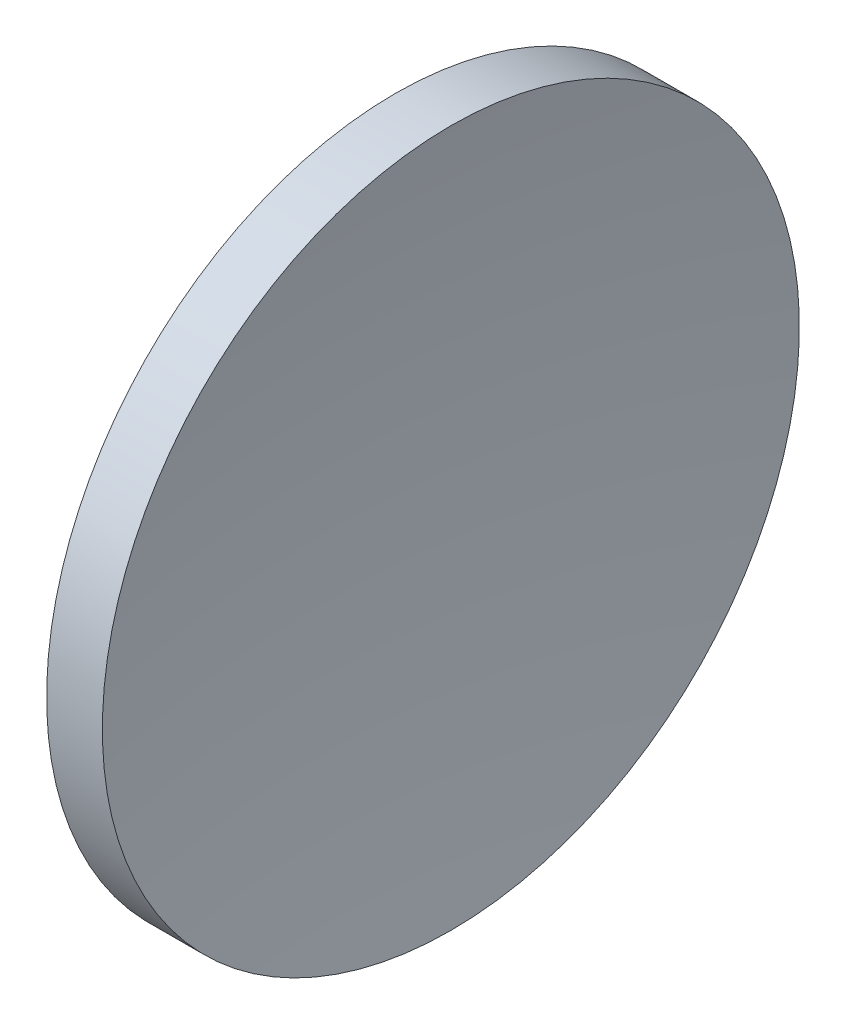
ISO-10303-21;
HEADER;
FILE_DESCRIPTION(('STEP AP214'),'2;1');
FILE_NAME('part.step','',(''),(''),'','','');
FILE_SCHEMA(('AUTOMOTIVE_DESIGN { 1 0 10303 214 1 1 1 1 }'));
ENDSEC;
DATA;
#1=APPLICATION_CONTEXT('core data for automotive mechanical design processes');
#2=APPLICATION_PROTOCOL_DEFINITION('international standard','automotive_design',2000,#1);
#3=PRODUCT_CONTEXT('',#1,'mechanical');
#4=PRODUCT('Part','Part','',(#3));
#5=PRODUCT_RELATED_PRODUCT_CATEGORY('part','',(#4));
#6=PRODUCT_DEFINITION_FORMATION('','',#4);
#7=PRODUCT_DEFINITION_CONTEXT('part definition',#1,'design');
#8=PRODUCT_DEFINITION('design','',#6,#7);
#9=PRODUCT_DEFINITION_SHAPE('','',#8);
#10=(LENGTH_UNIT() NAMED_UNIT(*) SI_UNIT(.MILLI.,.METRE.));
#11=(NAMED_UNIT(*) PLANE_ANGLE_UNIT() SI_UNIT($,.RADIAN.));
#12=(NAMED_UNIT(*) SI_UNIT($,.STERADIAN.) SOLID_ANGLE_UNIT());
#13=UNCERTAINTY_MEASURE_WITH_UNIT(LENGTH_MEASURE(1.E-05),#10,'distance_accuracy_value','');
#14=(GEOMETRIC_REPRESENTATION_CONTEXT(3) GLOBAL_UNCERTAINTY_ASSIGNED_CONTEXT((#13)) GLOBAL_UNIT_ASSIGNED_CONTEXT((#10,
#11,#12)) REPRESENTATION_CONTEXT('',''));
#15=CARTESIAN_POINT('',(0.,0.,0.));
#16=DIRECTION('',(0.,0.,1.));
#17=DIRECTION('',(1.,0.,0.));
#18=AXIS2_PLACEMENT_3D('',#15,#16,#17);
#19=CARTESIAN_POINT('',(352.198995671749,130.433680941881,0.));
#20=DIRECTION('',(-1.,0.,0.));
#21=DIRECTION('',(0.,1.,0.));
#22=AXIS2_PLACEMENT_3D('',#19,#20,#21);
#23=SPHERICAL_SURFACE('',#22,107.);
#24=CARTESIAN_POINT('',(248.160541242629,130.433680941881,0.));
#25=DIRECTION('',(-1.,0.,0.));
#26=DIRECTION('',(0.,-1.,0.));
#27=AXIS2_PLACEMENT_3D('',#24,#25,#26);
#28=CIRCLE('',#27,24.9999999999999);
#29=CARTESIAN_POINT('',(248.160541242629,105.433680941881,0.));
#30=VERTEX_POINT('',#29);
#31=EDGE_CURVE('E41',#30,#30,#28,.T.);
#32=ORIENTED_EDGE('',*,*,#31,.T.);
#33=EDGE_LOOP('',(#32));
#34=FACE_BOUND('',#33,.T.);
#35=ADVANCED_FACE('F35',(#34),#23,.T.);
#36=CARTESIAN_POINT('',(410.698995671749,130.433680941881,0.));
#37=DIRECTION('',(-1.,0.,0.));
#38=DIRECTION('',(0.,1.,0.));
#39=AXIS2_PLACEMENT_3D('',#36,#37,#38);
#40=SPHERICAL_SURFACE('',#39,160.5);
#41=CARTESIAN_POINT('',(252.157991511942,130.433680941881,0.));
#42=DIRECTION('',(-1.,0.,0.));
#43=DIRECTION('',(0.,-1.,0.));
#44=AXIS2_PLACEMENT_3D('',#41,#42,#43);
#45=CIRCLE('',#44,24.9999999999999);
#46=CARTESIAN_POINT('',(252.157991511942,105.433680941881,0.));
#47=VERTEX_POINT('',#46);
#48=EDGE_CURVE('E10',#47,#47,#45,.T.);
#49=ORIENTED_EDGE('',*,*,#48,.F.);
#50=EDGE_LOOP('',(#49));
#51=FACE_BOUND('',#50,.T.);
#52=ADVANCED_FACE('F50',(#51),#40,.F.);
#53=CARTESIAN_POINT('',(231.888982595926,130.433680941881,0.));
#54=DIRECTION('',(-1.,0.,0.));
#55=DIRECTION('',(0.,-1.,0.));
#56=AXIS2_PLACEMENT_3D('',#53,#54,#55);
#57=CYLINDRICAL_SURFACE('',#56,24.9999999999999);
#58=ORIENTED_EDGE('',*,*,#31,.F.);
#59=EDGE_LOOP('',(#58));
#60=FACE_BOUND('',#59,.T.);
#61=ORIENTED_EDGE('',*,*,#48,.T.);
#62=EDGE_LOOP('',(#61));
#63=FACE_BOUND('',#62,.T.);
#64=ADVANCED_FACE('F48',(#60,#63),#57,.T.);
#65=CLOSED_SHELL('',(#35,#52,#64));
#66=MANIFOLD_SOLID_BREP('B2',#65);
#67=ADVANCED_BREP_SHAPE_REPRESENTATION('',(#18,#66),#14);
#68=SHAPE_DEFINITION_REPRESENTATION(#9,#67);
ENDSEC;
END-ISO-10303-21;
